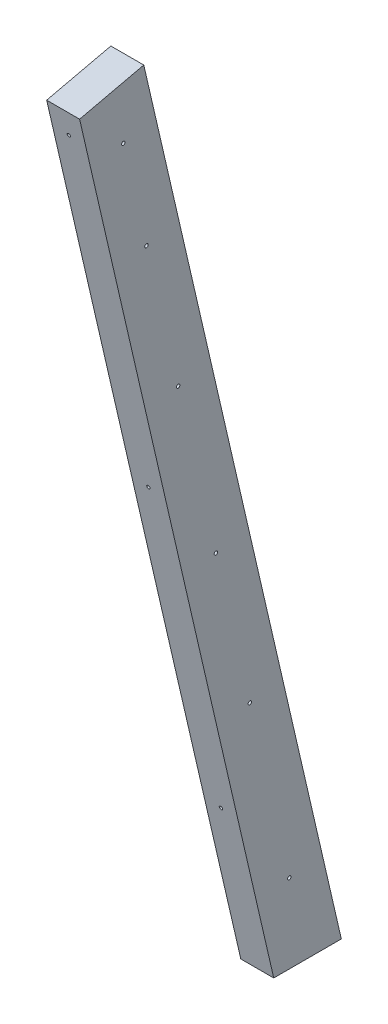
ISO-10303-21;
HEADER;
FILE_DESCRIPTION(('STEP AP214'),'2;1');
FILE_NAME('part.step','',(''),(''),'','','');
FILE_SCHEMA(('AUTOMOTIVE_DESIGN { 1 0 10303 214 1 1 1 1 }'));
ENDSEC;
DATA;
#1=APPLICATION_CONTEXT('core data for automotive mechanical design processes');
#2=APPLICATION_PROTOCOL_DEFINITION('international standard','automotive_design',2000,#1);
#3=PRODUCT_CONTEXT('',#1,'mechanical');
#4=PRODUCT('Part','Part','',(#3));
#5=PRODUCT_RELATED_PRODUCT_CATEGORY('part','',(#4));
#6=PRODUCT_DEFINITION_FORMATION('','',#4);
#7=PRODUCT_DEFINITION_CONTEXT('part definition',#1,'design');
#8=PRODUCT_DEFINITION('design','',#6,#7);
#9=PRODUCT_DEFINITION_SHAPE('','',#8);
#10=(LENGTH_UNIT() NAMED_UNIT(*) SI_UNIT(.MILLI.,.METRE.));
#11=(NAMED_UNIT(*) PLANE_ANGLE_UNIT() SI_UNIT($,.RADIAN.));
#12=(NAMED_UNIT(*) SI_UNIT($,.STERADIAN.) SOLID_ANGLE_UNIT());
#13=UNCERTAINTY_MEASURE_WITH_UNIT(LENGTH_MEASURE(1.E-05),#10,'distance_accuracy_value','');
#14=(GEOMETRIC_REPRESENTATION_CONTEXT(3) GLOBAL_UNCERTAINTY_ASSIGNED_CONTEXT((#13)) GLOBAL_UNIT_ASSIGNED_CONTEXT((#10,
#11,#12)) REPRESENTATION_CONTEXT('',''));
#15=CARTESIAN_POINT('',(0.,0.,0.));
#16=DIRECTION('',(0.,0.,1.));
#17=DIRECTION('',(1.,0.,0.));
#18=AXIS2_PLACEMENT_3D('',#15,#16,#17);
#19=CARTESIAN_POINT('',(-312.420000000002,5194.3,3108.48437157349));
#20=DIRECTION('',(0.,-1.,0.));
#21=DIRECTION('',(0.,0.,-1.));
#22=AXIS2_PLACEMENT_3D('',#19,#20,#21);
#23=PLANE('',#22);
#24=DIRECTION('',(-1.,0.,0.));
#25=VECTOR('',#24,1.);
#26=CARTESIAN_POINT('',(-312.420000000001,5194.30000000001,3147.58655808041));
#27=LINE('',#26,#25);
#28=CARTESIAN_POINT('',(-293.370000000002,5194.3,3147.58655808041));
#29=VERTEX_POINT('',#28);
#30=CARTESIAN_POINT('',(-312.420000000001,5194.3,3147.58655808041));
#31=VERTEX_POINT('',#30);
#32=EDGE_CURVE('E150',#29,#31,#27,.T.);
#33=ORIENTED_EDGE('',*,*,#32,.T.);
#34=DIRECTION('',(0.,0.,1.));
#35=VECTOR('',#34,1.);
#36=CARTESIAN_POINT('',(-312.420000000001,5194.3,3149.901148429));
#37=LINE('',#36,#35);
#38=CARTESIAN_POINT('',(-312.420000000001,5194.3,3108.48437157349));
#39=VERTEX_POINT('',#38);
#40=EDGE_CURVE('E153',#39,#31,#37,.T.);
#41=ORIENTED_EDGE('',*,*,#40,.F.);
#42=DIRECTION('',(-1.,0.,0.));
#43=VECTOR('',#42,1.);
#44=CARTESIAN_POINT('',(-312.420000000001,5194.3,3108.4843715735));
#45=LINE('',#44,#43);
#46=CARTESIAN_POINT('',(-293.370000000002,5194.30000000001,3108.48437157349));
#47=VERTEX_POINT('',#46);
#48=EDGE_CURVE('E155',#39,#47,#45,.F.);
#49=ORIENTED_EDGE('',*,*,#48,.T.);
#50=DIRECTION('',(0.,0.,1.));
#51=VECTOR('',#50,1.);
#52=CARTESIAN_POINT('',(-293.370000000002,5194.30000000001,3108.48437157349));
#53=LINE('',#52,#51);
#54=EDGE_CURVE('E143',#47,#29,#53,.T.);
#55=ORIENTED_EDGE('',*,*,#54,.T.);
#56=EDGE_LOOP('',(#33,#41,#49,#55));
#57=FACE_BOUND('',#56,.T.);
#58=ADVANCED_FACE('F41',(#57),#23,.T.);
#59=CARTESIAN_POINT('',(-312.420000000001,5194.30000000001,3147.58655808041));
#60=DIRECTION('',(0.,-0.224951054343807,0.974370064785249));
#61=DIRECTION('',(0.,-0.974370064785249,-0.224951054343807));
#62=AXIS2_PLACEMENT_3D('',#59,#60,#61);
#63=PLANE('',#62);
#64=CARTESIAN_POINT('',(-302.895,5666.2037733247,3256.53412861318));
#65=DIRECTION('',(0.,0.224951054343807,-0.974370064785249));
#66=DIRECTION('',(0.,-0.974370064785249,-0.224951054343807));
#67=AXIS2_PLACEMENT_3D('',#64,#65,#66);
#68=CIRCLE('',#67,0.991870000000006);
#69=CARTESIAN_POINT('',(-302.895,5665.23732488854,3256.31100641091));
#70=VERTEX_POINT('',#69);
#71=EDGE_CURVE('E44',#70,#70,#68,.T.);
#72=ORIENTED_EDGE('',*,*,#71,.T.);
#73=EDGE_LOOP('',(#72));
#74=FACE_BOUND('',#73,.T.);
#75=CARTESIAN_POINT('',(-302.895000000003,5466.8797897085,3210.51656106778));
#76=DIRECTION('',(0.,0.224951054343807,-0.974370064785249));
#77=DIRECTION('',(0.,-0.974370064785249,-0.224951054343807));
#78=AXIS2_PLACEMENT_3D('',#75,#76,#77);
#79=CIRCLE('',#78,0.991870000000006);
#80=CARTESIAN_POINT('',(-302.895000000003,5465.91334127234,3210.29343886551));
#81=VERTEX_POINT('',#80);
#82=EDGE_CURVE('E105',#81,#81,#79,.T.);
#83=ORIENTED_EDGE('',*,*,#82,.T.);
#84=EDGE_LOOP('',(#83));
#85=FACE_BOUND('',#84,.T.);
#86=CARTESIAN_POINT('',(-302.895,5285.233909112,3168.58030518907));
#87=DIRECTION('',(0.,0.224951054343807,-0.974370064785249));
#88=DIRECTION('',(0.,-0.974370064785249,-0.224951054343807));
#89=AXIS2_PLACEMENT_3D('',#86,#87,#88);
#90=CIRCLE('',#89,0.991870000000006);
#91=CARTESIAN_POINT('',(-302.895,5284.26746067584,3168.3571829868));
#92=VERTEX_POINT('',#91);
#93=EDGE_CURVE('E109',#92,#92,#90,.T.);
#94=ORIENTED_EDGE('',*,*,#93,.T.);
#95=EDGE_LOOP('',(#94));
#96=FACE_BOUND('',#95,.T.);
#97=DIRECTION('',(0.,0.974370064785226,0.224951054343907));
#98=VECTOR('',#97,1.);
#99=CARTESIAN_POINT('',(-312.420000000001,5194.30000000001,3147.58655808041));
#100=LINE('',#99,#98);
#101=CARTESIAN_POINT('',(-312.42,5680.70935774042,3259.88300664842));
#102=VERTEX_POINT('',#101);
#103=EDGE_CURVE('E49',#31,#102,#100,.T.);
#104=ORIENTED_EDGE('',*,*,#103,.F.);
#105=ORIENTED_EDGE('',*,*,#32,.F.);
#106=DIRECTION('',(0.,0.974370064785232,0.224951054343881));
#107=VECTOR('',#106,1.);
#108=CARTESIAN_POINT('',(-293.370000000002,5194.3,3147.58655808041));
#109=LINE('',#108,#107);
#110=CARTESIAN_POINT('',(-293.37,5680.70935774042,3259.88300664843));
#111=VERTEX_POINT('',#110);
#112=EDGE_CURVE('E146',#29,#111,#109,.T.);
#113=ORIENTED_EDGE('',*,*,#112,.T.);
#114=DIRECTION('',(-1.,0.,-2.79887224508002E-13));
#115=VECTOR('',#114,1.);
#116=CARTESIAN_POINT('',(-293.37,5680.70935774042,3259.88300664843));
#117=LINE('',#116,#115);
#118=EDGE_CURVE('E141',#111,#102,#117,.T.);
#119=ORIENTED_EDGE('',*,*,#118,.T.);
#120=EDGE_LOOP('',(#104,#105,#113,#119));
#121=FACE_BOUND('',#120,.T.);
#122=ADVANCED_FACE('F176',(#74,#85,#96,#121),#63,.T.);
#123=CARTESIAN_POINT('',(-312.420000000001,5392.29199716437,3154.19442581616));
#124=DIRECTION('',(0.,0.224951054343805,-0.97437006478525));
#125=DIRECTION('',(0.,0.974370064785249,0.224951054343805));
#126=AXIS2_PLACEMENT_3D('',#123,#124,#125);
#127=PLANE('',#126);
#128=ORIENTED_EDGE('',*,*,#48,.F.);
#129=DIRECTION('',(0.,-0.974370064785234,-0.224951054343871));
#130=VECTOR('',#129,1.);
#131=CARTESIAN_POINT('',(-312.420000000001,5392.29199716437,3154.19442581616));
#132=LINE('',#131,#130);
#133=CARTESIAN_POINT('',(-312.42,5689.27999291091,3222.75950718011));
#134=VERTEX_POINT('',#133);
#135=EDGE_CURVE('E11',#134,#39,#132,.T.);
#136=ORIENTED_EDGE('',*,*,#135,.F.);
#137=DIRECTION('',(1.,0.,0.));
#138=VECTOR('',#137,1.);
#139=CARTESIAN_POINT('',(-312.42,5689.27999291091,3222.75950718011));
#140=LINE('',#139,#138);
#141=CARTESIAN_POINT('',(-293.37,5689.27999291091,3222.75950718011));
#142=VERTEX_POINT('',#141);
#143=EDGE_CURVE('E136',#134,#142,#140,.T.);
#144=ORIENTED_EDGE('',*,*,#143,.T.);
#145=DIRECTION('',(0.,-0.974370064785238,-0.224951054343855));
#146=VECTOR('',#145,1.);
#147=CARTESIAN_POINT('',(-293.370000000001,5392.29199716437,3154.19442581616));
#148=LINE('',#147,#146);
#149=EDGE_CURVE('E149',#142,#47,#148,.T.);
#150=ORIENTED_EDGE('',*,*,#149,.T.);
#151=EDGE_LOOP('',(#128,#136,#144,#150));
#152=FACE_BOUND('',#151,.T.);
#153=ADVANCED_FACE('F200',(#152),#127,.T.);
#154=CARTESIAN_POINT('',(-312.420000000001,5293.29599858218,3149.90114842899));
#155=DIRECTION('',(1.,0.,0.));
#156=DIRECTION('',(0.,0.,1.));
#157=AXIS2_PLACEMENT_3D('',#154,#155,#156);
#158=PLANE('',#157);
#159=CARTESIAN_POINT('',(-312.420000000001,5655.98350649425,3234.62350084372));
#160=DIRECTION('',(-1.,0.,0.));
#161=DIRECTION('',(0.,0.,1.));
#162=AXIS2_PLACEMENT_3D('',#159,#160,#161);
#163=CIRCLE('',#162,0.991870000000006);
#164=CARTESIAN_POINT('',(-312.420000000001,5655.98350649425,3235.61537084372));
#165=VERTEX_POINT('',#164);
#166=EDGE_CURVE('E110',#165,#165,#163,.T.);
#167=ORIENTED_EDGE('',*,*,#166,.F.);
#168=EDGE_LOOP('',(#167));
#169=FACE_BOUND('',#168,.T.);
#170=CARTESIAN_POINT('',(-312.420000000002,5597.96116883142,3221.22798870264));
#171=DIRECTION('',(-1.,0.,0.));
#172=DIRECTION('',(0.,0.,1.));
#173=AXIS2_PLACEMENT_3D('',#170,#171,#172);
#174=CIRCLE('',#173,0.991870000000006);
#175=CARTESIAN_POINT('',(-312.420000000002,5597.96116883142,3222.21985870264));
#176=VERTEX_POINT('',#175);
#177=EDGE_CURVE('E115',#176,#176,#174,.T.);
#178=ORIENTED_EDGE('',*,*,#177,.F.);
#179=EDGE_LOOP('',(#178));
#180=FACE_BOUND('',#179,.T.);
#181=CARTESIAN_POINT('',(-312.420000000001,5518.40604291751,3202.86124068814));
#182=DIRECTION('',(-1.,0.,0.));
#183=DIRECTION('',(0.,0.,1.));
#184=AXIS2_PLACEMENT_3D('',#181,#182,#183);
#185=CIRCLE('',#184,0.991870000000006);
#186=CARTESIAN_POINT('',(-312.420000000001,5518.40604291751,3203.85311068814));
#187=VERTEX_POINT('',#186);
#188=EDGE_CURVE('E118',#187,#187,#185,.T.);
#189=ORIENTED_EDGE('',*,*,#188,.F.);
#190=EDGE_LOOP('',(#189));
#191=FACE_BOUND('',#190,.T.);
#192=CARTESIAN_POINT('',(-312.42,5423.92417167001,3181.04838197908));
#193=DIRECTION('',(-1.,0.,0.));
#194=DIRECTION('',(0.,0.,1.));
#195=AXIS2_PLACEMENT_3D('',#192,#193,#194);
#196=CIRCLE('',#195,0.991870000000006);
#197=CARTESIAN_POINT('',(-312.42,5423.92417167001,3182.04025197908));
#198=VERTEX_POINT('',#197);
#199=EDGE_CURVE('E123',#198,#198,#196,.T.);
#200=ORIENTED_EDGE('',*,*,#199,.F.);
#201=EDGE_LOOP('',(#200));
#202=FACE_BOUND('',#201,.T.);
#203=CARTESIAN_POINT('',(-312.42,5339.0676906789,3161.45771970739));
#204=DIRECTION('',(-1.,0.,0.));
#205=DIRECTION('',(0.,0.,1.));
#206=AXIS2_PLACEMENT_3D('',#203,#204,#205);
#207=CIRCLE('',#206,0.991870000000006);
#208=CARTESIAN_POINT('',(-312.42,5339.0676906789,3162.44958970739));
#209=VERTEX_POINT('',#208);
#210=EDGE_CURVE('E127',#209,#209,#207,.T.);
#211=ORIENTED_EDGE('',*,*,#210,.F.);
#212=EDGE_LOOP('',(#211));
#213=FACE_BOUND('',#212,.T.);
#214=CARTESIAN_POINT('',(-312.420000000001,5239.9707627156,3138.57939120242));
#215=DIRECTION('',(-1.,0.,0.));
#216=DIRECTION('',(0.,0.,1.));
#217=AXIS2_PLACEMENT_3D('',#214,#215,#216);
#218=CIRCLE('',#217,0.991870000000006);
#219=CARTESIAN_POINT('',(-312.420000000001,5239.9707627156,3139.57126120242));
#220=VERTEX_POINT('',#219);
#221=EDGE_CURVE('E131',#220,#220,#218,.T.);
#222=ORIENTED_EDGE('',*,*,#221,.F.);
#223=EDGE_LOOP('',(#222));
#224=FACE_BOUND('',#223,.T.);
#225=ORIENTED_EDGE('',*,*,#135,.T.);
#226=ORIENTED_EDGE('',*,*,#40,.T.);
#227=ORIENTED_EDGE('',*,*,#103,.T.);
#228=DIRECTION('',(0.,0.224951054343675,-0.974370064785279));
#229=VECTOR('',#228,1.);
#230=CARTESIAN_POINT('',(-312.42,5680.70935774042,3259.88300664842));
#231=LINE('',#230,#229);
#232=EDGE_CURVE('E134',#102,#134,#231,.T.);
#233=ORIENTED_EDGE('',*,*,#232,.T.);
#234=EDGE_LOOP('',(#225,#226,#227,#233));
#235=FACE_BOUND('',#234,.T.);
#236=ADVANCED_FACE('F211',(#169,#180,#191,#202,#213,#224,#235),#158,.F.);
#237=CARTESIAN_POINT('',(-293.37,0.,-4.44089209850063E-13));
#238=DIRECTION('',(1.,0.,0.));
#239=DIRECTION('',(0.,0.,1.));
#240=AXIS2_PLACEMENT_3D('',#237,#238,#239);
#241=PLANE('',#240);
#242=CARTESIAN_POINT('',(-293.370000000001,5655.98350649425,3234.62350084372));
#243=DIRECTION('',(-1.,0.,0.));
#244=DIRECTION('',(0.,0.,1.));
#245=AXIS2_PLACEMENT_3D('',#242,#243,#244);
#246=CIRCLE('',#245,0.991870000000006);
#247=CARTESIAN_POINT('',(-293.370000000001,5655.98350649425,3235.61537084372));
#248=VERTEX_POINT('',#247);
#249=EDGE_CURVE('E114',#248,#248,#246,.T.);
#250=ORIENTED_EDGE('',*,*,#249,.T.);
#251=EDGE_LOOP('',(#250));
#252=FACE_BOUND('',#251,.T.);
#253=CARTESIAN_POINT('',(-293.370000000001,5597.96116883142,3221.22798870264));
#254=DIRECTION('',(-1.,0.,0.));
#255=DIRECTION('',(0.,0.,1.));
#256=AXIS2_PLACEMENT_3D('',#253,#254,#255);
#257=CIRCLE('',#256,0.991870000000006);
#258=CARTESIAN_POINT('',(-293.370000000001,5597.96116883142,3222.21985870264));
#259=VERTEX_POINT('',#258);
#260=EDGE_CURVE('E113',#259,#259,#257,.T.);
#261=ORIENTED_EDGE('',*,*,#260,.T.);
#262=EDGE_LOOP('',(#261));
#263=FACE_BOUND('',#262,.T.);
#264=CARTESIAN_POINT('',(-293.370000000001,5518.40604291751,3202.86124068814));
#265=DIRECTION('',(-1.,0.,0.));
#266=DIRECTION('',(0.,0.,1.));
#267=AXIS2_PLACEMENT_3D('',#264,#265,#266);
#268=CIRCLE('',#267,0.991870000000006);
#269=CARTESIAN_POINT('',(-293.370000000001,5518.40604291751,3203.85311068814));
#270=VERTEX_POINT('',#269);
#271=EDGE_CURVE('E119',#270,#270,#268,.T.);
#272=ORIENTED_EDGE('',*,*,#271,.T.);
#273=EDGE_LOOP('',(#272));
#274=FACE_BOUND('',#273,.T.);
#275=CARTESIAN_POINT('',(-293.37,5423.92417167001,3181.04838197908));
#276=DIRECTION('',(-1.,0.,0.));
#277=DIRECTION('',(0.,0.,1.));
#278=AXIS2_PLACEMENT_3D('',#275,#276,#277);
#279=CIRCLE('',#278,0.991870000000006);
#280=CARTESIAN_POINT('',(-293.37,5423.92417167001,3182.04025197908));
#281=VERTEX_POINT('',#280);
#282=EDGE_CURVE('E122',#281,#281,#279,.T.);
#283=ORIENTED_EDGE('',*,*,#282,.T.);
#284=EDGE_LOOP('',(#283));
#285=FACE_BOUND('',#284,.T.);
#286=CARTESIAN_POINT('',(-293.370000000001,5339.0676906789,3161.45771970739));
#287=DIRECTION('',(-1.,0.,0.));
#288=DIRECTION('',(0.,0.,1.));
#289=AXIS2_PLACEMENT_3D('',#286,#287,#288);
#290=CIRCLE('',#289,0.991870000000006);
#291=CARTESIAN_POINT('',(-293.370000000001,5339.0676906789,3162.44958970739));
#292=VERTEX_POINT('',#291);
#293=EDGE_CURVE('E126',#292,#292,#290,.T.);
#294=ORIENTED_EDGE('',*,*,#293,.T.);
#295=EDGE_LOOP('',(#294));
#296=FACE_BOUND('',#295,.T.);
#297=CARTESIAN_POINT('',(-293.37,5239.9707627156,3138.57939120242));
#298=DIRECTION('',(-1.,0.,0.));
#299=DIRECTION('',(0.,0.,1.));
#300=AXIS2_PLACEMENT_3D('',#297,#298,#299);
#301=CIRCLE('',#300,0.991870000000006);
#302=CARTESIAN_POINT('',(-293.37,5239.9707627156,3139.57126120242));
#303=VERTEX_POINT('',#302);
#304=EDGE_CURVE('E130',#303,#303,#301,.T.);
#305=ORIENTED_EDGE('',*,*,#304,.T.);
#306=EDGE_LOOP('',(#305));
#307=FACE_BOUND('',#306,.T.);
#308=ORIENTED_EDGE('',*,*,#54,.F.);
#309=ORIENTED_EDGE('',*,*,#149,.F.);
#310=DIRECTION('',(0.,-0.224951054343666,0.974370064785281));
#311=VECTOR('',#310,1.);
#312=CARTESIAN_POINT('',(-293.37,5689.27999291091,3222.75950718011));
#313=LINE('',#312,#311);
#314=EDGE_CURVE('E139',#142,#111,#313,.T.);
#315=ORIENTED_EDGE('',*,*,#314,.T.);
#316=ORIENTED_EDGE('',*,*,#112,.F.);
#317=EDGE_LOOP('',(#308,#309,#315,#316));
#318=FACE_BOUND('',#317,.T.);
#319=ADVANCED_FACE('F206',(#252,#263,#274,#285,#296,#307,#318),#241,.T.);
#320=CARTESIAN_POINT('',(-2.22044604925031E-12,6107.767879628,1410.08932218327));
#321=DIRECTION('',(0.,0.974370064785279,0.224951054343675));
#322=DIRECTION('',(0.,-0.224951054343675,0.974370064785279));
#323=AXIS2_PLACEMENT_3D('',#320,#321,#322);
#324=PLANE('',#323);
#325=ORIENTED_EDGE('',*,*,#232,.F.);
#326=ORIENTED_EDGE('',*,*,#118,.F.);
#327=ORIENTED_EDGE('',*,*,#314,.F.);
#328=ORIENTED_EDGE('',*,*,#143,.F.);
#329=EDGE_LOOP('',(#325,#326,#327,#328));
#330=FACE_BOUND('',#329,.T.);
#331=ADVANCED_FACE('F210',(#330),#324,.T.);
#332=CARTESIAN_POINT('',(-325.120000000001,5239.9707627156,3138.57939120242));
#333=DIRECTION('',(-1.,0.,0.));
#334=DIRECTION('',(0.,0.,-1.));
#335=AXIS2_PLACEMENT_3D('',#332,#333,#334);
#336=CYLINDRICAL_SURFACE('',#335,0.991870000000006);
#337=ORIENTED_EDGE('',*,*,#304,.F.);
#338=EDGE_LOOP('',(#337));
#339=FACE_BOUND('',#338,.T.);
#340=ORIENTED_EDGE('',*,*,#221,.T.);
#341=EDGE_LOOP('',(#340));
#342=FACE_BOUND('',#341,.T.);
#343=ADVANCED_FACE('F228',(#339,#342),#336,.F.);
#344=CARTESIAN_POINT('',(-325.120000000002,5339.0676906789,3161.45771970739));
#345=DIRECTION('',(-1.,0.,0.));
#346=DIRECTION('',(0.,0.,-1.));
#347=AXIS2_PLACEMENT_3D('',#344,#345,#346);
#348=CYLINDRICAL_SURFACE('',#347,0.991870000000006);
#349=ORIENTED_EDGE('',*,*,#293,.F.);
#350=EDGE_LOOP('',(#349));
#351=FACE_BOUND('',#350,.T.);
#352=ORIENTED_EDGE('',*,*,#210,.T.);
#353=EDGE_LOOP('',(#352));
#354=FACE_BOUND('',#353,.T.);
#355=ADVANCED_FACE('F231',(#351,#354),#348,.F.);
#356=CARTESIAN_POINT('',(-325.120000000001,5423.92417167001,3181.04838197908));
#357=DIRECTION('',(-1.,0.,0.));
#358=DIRECTION('',(0.,0.,-1.));
#359=AXIS2_PLACEMENT_3D('',#356,#357,#358);
#360=CYLINDRICAL_SURFACE('',#359,0.991870000000006);
#361=ORIENTED_EDGE('',*,*,#282,.F.);
#362=EDGE_LOOP('',(#361));
#363=FACE_BOUND('',#362,.T.);
#364=ORIENTED_EDGE('',*,*,#199,.T.);
#365=EDGE_LOOP('',(#364));
#366=FACE_BOUND('',#365,.T.);
#367=ADVANCED_FACE('F235',(#363,#366),#360,.F.);
#368=CARTESIAN_POINT('',(-325.12,5518.40604291751,3202.86124068814));
#369=DIRECTION('',(-1.,0.,0.));
#370=DIRECTION('',(0.,0.,-1.));
#371=AXIS2_PLACEMENT_3D('',#368,#369,#370);
#372=CYLINDRICAL_SURFACE('',#371,0.991870000000006);
#373=ORIENTED_EDGE('',*,*,#271,.F.);
#374=EDGE_LOOP('',(#373));
#375=FACE_BOUND('',#374,.T.);
#376=ORIENTED_EDGE('',*,*,#188,.T.);
#377=EDGE_LOOP('',(#376));
#378=FACE_BOUND('',#377,.T.);
#379=ADVANCED_FACE('F239',(#375,#378),#372,.F.);
#380=CARTESIAN_POINT('',(-325.120000000001,5597.96116883142,3221.22798870264));
#381=DIRECTION('',(-1.,0.,0.));
#382=DIRECTION('',(0.,0.,-1.));
#383=AXIS2_PLACEMENT_3D('',#380,#381,#382);
#384=CYLINDRICAL_SURFACE('',#383,0.991870000000006);
#385=ORIENTED_EDGE('',*,*,#260,.F.);
#386=EDGE_LOOP('',(#385));
#387=FACE_BOUND('',#386,.T.);
#388=ORIENTED_EDGE('',*,*,#177,.T.);
#389=EDGE_LOOP('',(#388));
#390=FACE_BOUND('',#389,.T.);
#391=ADVANCED_FACE('F243',(#387,#390),#384,.F.);
#392=CARTESIAN_POINT('',(-325.120000000002,5655.98350649425,3234.62350084372));
#393=DIRECTION('',(-1.,0.,0.));
#394=DIRECTION('',(0.,0.,-1.));
#395=AXIS2_PLACEMENT_3D('',#392,#393,#394);
#396=CYLINDRICAL_SURFACE('',#395,0.991870000000006);
#397=ORIENTED_EDGE('',*,*,#249,.F.);
#398=EDGE_LOOP('',(#397));
#399=FACE_BOUND('',#398,.T.);
#400=ORIENTED_EDGE('',*,*,#166,.T.);
#401=EDGE_LOOP('',(#400));
#402=FACE_BOUND('',#401,.T.);
#403=ADVANCED_FACE('F247',(#399,#402),#396,.F.);
#404=CARTESIAN_POINT('',(-302.895000000002,5289.51922669725,3150.01855545492));
#405=DIRECTION('',(0.,-0.224951054343807,0.974370064785249));
#406=DIRECTION('',(0.,-0.974370064785249,-0.224951054343807));
#407=AXIS2_PLACEMENT_3D('',#404,#405,#406);
#408=CONICAL_SURFACE('',#407,0.991870000000006,1.02974425867663);
#409=CARTESIAN_POINT('',(-302.895000000002,5289.65329204182,3149.43785464932));
#410=VERTEX_POINT('',#409);
#411=VERTEX_LOOP('',#410);
#412=FACE_BOUND('',#411,.T.);
#413=CARTESIAN_POINT('',(-302.895000000002,5289.51922669725,3150.01855545492));
#414=DIRECTION('',(0.,0.224951054343807,-0.974370064785249));
#415=DIRECTION('',(0.,-0.974370064785249,-0.224951054343807));
#416=AXIS2_PLACEMENT_3D('',#413,#414,#415);
#417=CIRCLE('',#416,0.991870000000006);
#418=CARTESIAN_POINT('',(-302.895000000002,5288.55277826109,3149.79543325265));
#419=VERTEX_POINT('',#418);
#420=EDGE_CURVE('E106',#419,#419,#417,.T.);
#421=ORIENTED_EDGE('',*,*,#420,.F.);
#422=EDGE_LOOP('',(#421));
#423=FACE_BOUND('',#422,.T.);
#424=ADVANCED_FACE('F192',(#412,#423),#408,.F.);
#425=CARTESIAN_POINT('',(-302.895000000001,5280.94859152675,3187.14205492324));
#426=DIRECTION('',(0.,-0.224951054343807,0.974370064785249));
#427=DIRECTION('',(0.,-0.974370064785249,-0.224951054343807));
#428=AXIS2_PLACEMENT_3D('',#425,#426,#427);
#429=CYLINDRICAL_SURFACE('',#428,0.991870000000006);
#430=ORIENTED_EDGE('',*,*,#93,.F.);
#431=EDGE_LOOP('',(#430));
#432=FACE_BOUND('',#431,.T.);
#433=ORIENTED_EDGE('',*,*,#420,.T.);
#434=EDGE_LOOP('',(#433));
#435=FACE_BOUND('',#434,.T.);
#436=ADVANCED_FACE('F186',(#432,#435),#429,.F.);
#437=CARTESIAN_POINT('',(-302.895000000003,5471.16510729375,3191.95481133364));
#438=DIRECTION('',(0.,-0.224951054343807,0.974370064785249));
#439=DIRECTION('',(0.,-0.974370064785249,-0.224951054343807));
#440=AXIS2_PLACEMENT_3D('',#437,#438,#439);
#441=CONICAL_SURFACE('',#440,0.991870000000006,1.02974425867663);
#442=CARTESIAN_POINT('',(-302.895000000004,5471.29917263833,3191.37411052803));
#443=VERTEX_POINT('',#442);
#444=VERTEX_LOOP('',#443);
#445=FACE_BOUND('',#444,.T.);
#446=CARTESIAN_POINT('',(-302.895000000003,5471.16510729375,3191.95481133364));
#447=DIRECTION('',(0.,0.224951054343807,-0.974370064785249));
#448=DIRECTION('',(0.,-0.974370064785249,-0.224951054343807));
#449=AXIS2_PLACEMENT_3D('',#446,#447,#448);
#450=CIRCLE('',#449,0.991870000000006);
#451=CARTESIAN_POINT('',(-302.895000000003,5470.19865885759,3191.73168913136));
#452=VERTEX_POINT('',#451);
#453=EDGE_CURVE('E101',#452,#452,#450,.T.);
#454=ORIENTED_EDGE('',*,*,#453,.F.);
#455=EDGE_LOOP('',(#454));
#456=FACE_BOUND('',#455,.T.);
#457=ADVANCED_FACE('F181',(#445,#456),#441,.F.);
#458=CARTESIAN_POINT('',(-302.895000000004,5462.59447212325,3229.07831080195));
#459=DIRECTION('',(0.,-0.224951054343807,0.974370064785249));
#460=DIRECTION('',(0.,-0.974370064785249,-0.224951054343807));
#461=AXIS2_PLACEMENT_3D('',#458,#459,#460);
#462=CYLINDRICAL_SURFACE('',#461,0.991870000000006);
#463=ORIENTED_EDGE('',*,*,#82,.F.);
#464=EDGE_LOOP('',(#463));
#465=FACE_BOUND('',#464,.T.);
#466=ORIENTED_EDGE('',*,*,#453,.T.);
#467=EDGE_LOOP('',(#466));
#468=FACE_BOUND('',#467,.T.);
#469=ADVANCED_FACE('F93',(#465,#468),#462,.F.);
#470=CARTESIAN_POINT('',(-302.895,5670.48909090995,3237.97237887904));
#471=DIRECTION('',(0.,-0.224951054343807,0.974370064785249));
#472=DIRECTION('',(0.,-0.974370064785249,-0.224951054343807));
#473=AXIS2_PLACEMENT_3D('',#470,#471,#472);
#474=CONICAL_SURFACE('',#473,0.991870000000006,1.02974425867663);
#475=CARTESIAN_POINT('',(-302.895,5670.62315625453,3237.39167807343));
#476=VERTEX_POINT('',#475);
#477=VERTEX_LOOP('',#476);
#478=FACE_BOUND('',#477,.T.);
#479=CARTESIAN_POINT('',(-302.895,5670.48909090995,3237.97237887904));
#480=DIRECTION('',(0.,0.224951054343807,-0.974370064785249));
#481=DIRECTION('',(0.,-0.974370064785249,-0.224951054343807));
#482=AXIS2_PLACEMENT_3D('',#479,#480,#481);
#483=CIRCLE('',#482,0.991870000000006);
#484=CARTESIAN_POINT('',(-302.895,5669.52264247379,3237.74925667677));
#485=VERTEX_POINT('',#484);
#486=EDGE_CURVE('E97',#485,#485,#483,.T.);
#487=ORIENTED_EDGE('',*,*,#486,.F.);
#488=EDGE_LOOP('',(#487));
#489=FACE_BOUND('',#488,.T.);
#490=ADVANCED_FACE('F89',(#478,#489),#474,.F.);
#491=CARTESIAN_POINT('',(-302.895,5661.91845573945,3275.09587834736));
#492=DIRECTION('',(0.,-0.224951054343807,0.974370064785249));
#493=DIRECTION('',(0.,-0.974370064785249,-0.224951054343807));
#494=AXIS2_PLACEMENT_3D('',#491,#492,#493);
#495=CYLINDRICAL_SURFACE('',#494,0.991870000000006);
#496=ORIENTED_EDGE('',*,*,#71,.F.);
#497=EDGE_LOOP('',(#496));
#498=FACE_BOUND('',#497,.T.);
#499=ORIENTED_EDGE('',*,*,#486,.T.);
#500=EDGE_LOOP('',(#499));
#501=FACE_BOUND('',#500,.T.);
#502=ADVANCED_FACE('F92',(#498,#501),#495,.F.);
#503=CLOSED_SHELL('',(#58,#122,#153,#236,#319,#331,#343,#355,#367,#379,#391,#403,#424,#436,#457,
#469,#490,#502));
#504=MANIFOLD_SOLID_BREP('B2',#503);
#505=ADVANCED_BREP_SHAPE_REPRESENTATION('',(#18,#504),#14);
#506=SHAPE_DEFINITION_REPRESENTATION(#9,#505);
ENDSEC;
END-ISO-10303-21;
